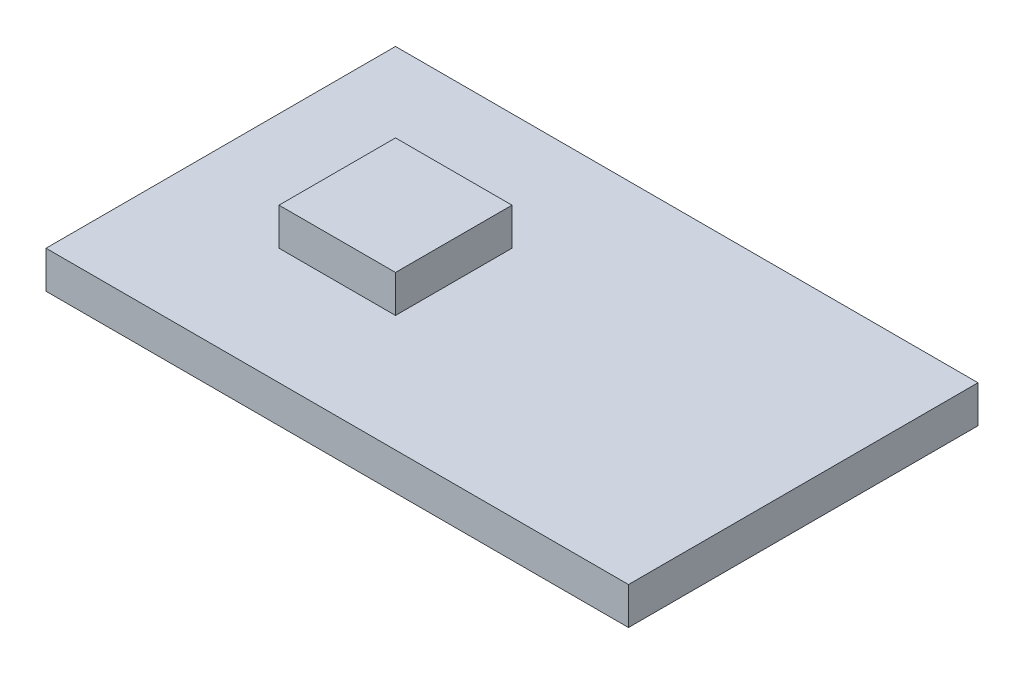
ISO-10303-21;
HEADER;
FILE_DESCRIPTION(('STEP AP214'),'2;1');
FILE_NAME('part.step','',(''),(''),'','','');
FILE_SCHEMA(('AUTOMOTIVE_DESIGN { 1 0 10303 214 1 1 1 1 }'));
ENDSEC;
DATA;
#1=APPLICATION_CONTEXT('core data for automotive mechanical design processes');
#2=APPLICATION_PROTOCOL_DEFINITION('international standard','automotive_design',2000,#1);
#3=PRODUCT_CONTEXT('',#1,'mechanical');
#4=PRODUCT('Part','Part','',(#3));
#5=PRODUCT_RELATED_PRODUCT_CATEGORY('part','',(#4));
#6=PRODUCT_DEFINITION_FORMATION('','',#4);
#7=PRODUCT_DEFINITION_CONTEXT('part definition',#1,'design');
#8=PRODUCT_DEFINITION('design','',#6,#7);
#9=PRODUCT_DEFINITION_SHAPE('','',#8);
#10=(LENGTH_UNIT() NAMED_UNIT(*) SI_UNIT(.MILLI.,.METRE.));
#11=(NAMED_UNIT(*) PLANE_ANGLE_UNIT() SI_UNIT($,.RADIAN.));
#12=(NAMED_UNIT(*) SI_UNIT($,.STERADIAN.) SOLID_ANGLE_UNIT());
#13=UNCERTAINTY_MEASURE_WITH_UNIT(LENGTH_MEASURE(1.E-05),#10,'distance_accuracy_value','');
#14=(GEOMETRIC_REPRESENTATION_CONTEXT(3) GLOBAL_UNCERTAINTY_ASSIGNED_CONTEXT((#13)) GLOBAL_UNIT_ASSIGNED_CONTEXT((#10,
#11,#12)) REPRESENTATION_CONTEXT('',''));
#15=CARTESIAN_POINT('',(0.,0.,0.));
#16=DIRECTION('',(0.,0.,1.));
#17=DIRECTION('',(1.,0.,0.));
#18=AXIS2_PLACEMENT_3D('',#15,#16,#17);
#19=CARTESIAN_POINT('',(7.9375,1.016,-4.7625));
#20=DIRECTION('',(0.,-1.,0.));
#21=DIRECTION('',(0.,0.,-1.));
#22=AXIS2_PLACEMENT_3D('',#19,#20,#21);
#23=PLANE('',#22);
#24=DIRECTION('',(0.,0.,-1.));
#25=VECTOR('',#24,1.);
#26=CARTESIAN_POINT('',(7.9375,1.016,4.7625));
#27=LINE('',#26,#25);
#28=CARTESIAN_POINT('',(7.9375,1.016,4.7625));
#29=VERTEX_POINT('',#28);
#30=CARTESIAN_POINT('',(7.9375,1.016,-4.7625));
#31=VERTEX_POINT('',#30);
#32=EDGE_CURVE('E125',#29,#31,#27,.T.);
#33=ORIENTED_EDGE('',*,*,#32,.T.);
#34=DIRECTION('',(-1.,0.,0.));
#35=VECTOR('',#34,1.);
#36=CARTESIAN_POINT('',(-7.9375,1.016,-4.7625));
#37=LINE('',#36,#35);
#38=CARTESIAN_POINT('',(-7.9375,1.016,-4.7625));
#39=VERTEX_POINT('',#38);
#40=EDGE_CURVE('E128',#31,#39,#37,.T.);
#41=ORIENTED_EDGE('',*,*,#40,.T.);
#42=DIRECTION('',(0.,0.,1.));
#43=VECTOR('',#42,1.);
#44=CARTESIAN_POINT('',(-7.9375,1.016,4.7625));
#45=LINE('',#44,#43);
#46=CARTESIAN_POINT('',(-7.9375,1.016,4.7625));
#47=VERTEX_POINT('',#46);
#48=EDGE_CURVE('E131',#39,#47,#45,.T.);
#49=ORIENTED_EDGE('',*,*,#48,.T.);
#50=DIRECTION('',(1.,0.,0.));
#51=VECTOR('',#50,1.);
#52=CARTESIAN_POINT('',(-7.9375,1.016,4.7625));
#53=LINE('',#52,#51);
#54=EDGE_CURVE('E133',#47,#29,#53,.T.);
#55=ORIENTED_EDGE('',*,*,#54,.T.);
#56=EDGE_LOOP('',(#33,#41,#49,#55));
#57=FACE_BOUND('',#56,.T.);
#58=DIRECTION('',(0.,0.,-1.));
#59=VECTOR('',#58,1.);
#60=CARTESIAN_POINT('',(-1.5875,1.016,1.5875));
#61=LINE('',#60,#59);
#62=CARTESIAN_POINT('',(-1.5875,1.016,1.5875));
#63=VERTEX_POINT('',#62);
#64=CARTESIAN_POINT('',(-1.5875,1.016,-1.5875));
#65=VERTEX_POINT('',#64);
#66=EDGE_CURVE('E115',#63,#65,#61,.T.);
#67=ORIENTED_EDGE('',*,*,#66,.F.);
#68=DIRECTION('',(1.,0.,0.));
#69=VECTOR('',#68,1.);
#70=CARTESIAN_POINT('',(-4.7625,1.016,1.5875));
#71=LINE('',#70,#69);
#72=CARTESIAN_POINT('',(-4.7625,1.016,1.5875));
#73=VERTEX_POINT('',#72);
#74=EDGE_CURVE('E112',#73,#63,#71,.T.);
#75=ORIENTED_EDGE('',*,*,#74,.F.);
#76=DIRECTION('',(0.,0.,1.));
#77=VECTOR('',#76,1.);
#78=CARTESIAN_POINT('',(-4.7625,1.016,1.5875));
#79=LINE('',#78,#77);
#80=CARTESIAN_POINT('',(-4.7625,1.016,-1.5875));
#81=VERTEX_POINT('',#80);
#82=EDGE_CURVE('E50',#81,#73,#79,.T.);
#83=ORIENTED_EDGE('',*,*,#82,.F.);
#84=DIRECTION('',(-1.,0.,0.));
#85=VECTOR('',#84,1.);
#86=CARTESIAN_POINT('',(-4.7625,1.016,-1.5875));
#87=LINE('',#86,#85);
#88=EDGE_CURVE('E45',#65,#81,#87,.T.);
#89=ORIENTED_EDGE('',*,*,#88,.F.);
#90=EDGE_LOOP('',(#67,#75,#83,#89));
#91=FACE_BOUND('',#90,.T.);
#92=ADVANCED_FACE('F30',(#57,#91),#23,.F.);
#93=CARTESIAN_POINT('',(7.9375,1.016,4.7625));
#94=DIRECTION('',(-1.,0.,0.));
#95=DIRECTION('',(0.,0.,1.));
#96=AXIS2_PLACEMENT_3D('',#93,#94,#95);
#97=PLANE('',#96);
#98=DIRECTION('',(0.,0.,-1.));
#99=VECTOR('',#98,1.);
#100=CARTESIAN_POINT('',(7.9375,0.,4.7625));
#101=LINE('',#100,#99);
#102=CARTESIAN_POINT('',(7.9375,0.,4.7625));
#103=VERTEX_POINT('',#102);
#104=CARTESIAN_POINT('',(7.9375,0.,-4.7625));
#105=VERTEX_POINT('',#104);
#106=EDGE_CURVE('E116',#103,#105,#101,.T.);
#107=ORIENTED_EDGE('',*,*,#106,.T.);
#108=DIRECTION('',(0.,-1.,0.));
#109=VECTOR('',#108,1.);
#110=CARTESIAN_POINT('',(7.9375,1.016,-4.7625));
#111=LINE('',#110,#109);
#112=EDGE_CURVE('E11',#31,#105,#111,.T.);
#113=ORIENTED_EDGE('',*,*,#112,.F.);
#114=ORIENTED_EDGE('',*,*,#32,.F.);
#115=DIRECTION('',(0.,-1.,0.));
#116=VECTOR('',#115,1.);
#117=CARTESIAN_POINT('',(7.9375,1.016,4.7625));
#118=LINE('',#117,#116);
#119=EDGE_CURVE('E134',#29,#103,#118,.T.);
#120=ORIENTED_EDGE('',*,*,#119,.T.);
#121=EDGE_LOOP('',(#107,#113,#114,#120));
#122=FACE_BOUND('',#121,.T.);
#123=ADVANCED_FACE('F32',(#122),#97,.F.);
#124=CARTESIAN_POINT('',(-7.9375,1.016,-4.7625));
#125=DIRECTION('',(0.,0.,1.));
#126=DIRECTION('',(1.,0.,0.));
#127=AXIS2_PLACEMENT_3D('',#124,#125,#126);
#128=PLANE('',#127);
#129=DIRECTION('',(-1.,0.,0.));
#130=VECTOR('',#129,1.);
#131=CARTESIAN_POINT('',(-7.9375,0.,-4.7625));
#132=LINE('',#131,#130);
#133=CARTESIAN_POINT('',(-7.9375,0.,-4.7625));
#134=VERTEX_POINT('',#133);
#135=EDGE_CURVE('E119',#105,#134,#132,.T.);
#136=ORIENTED_EDGE('',*,*,#135,.T.);
#137=DIRECTION('',(0.,-1.,0.));
#138=VECTOR('',#137,1.);
#139=CARTESIAN_POINT('',(-7.9375,1.016,-4.7625));
#140=LINE('',#139,#138);
#141=EDGE_CURVE('E38',#39,#134,#140,.T.);
#142=ORIENTED_EDGE('',*,*,#141,.F.);
#143=ORIENTED_EDGE('',*,*,#40,.F.);
#144=ORIENTED_EDGE('',*,*,#112,.T.);
#145=EDGE_LOOP('',(#136,#142,#143,#144));
#146=FACE_BOUND('',#145,.T.);
#147=ADVANCED_FACE('F164',(#146),#128,.F.);
#148=CARTESIAN_POINT('',(-7.9375,1.016,4.7625));
#149=DIRECTION('',(1.,0.,0.));
#150=DIRECTION('',(0.,0.,-1.));
#151=AXIS2_PLACEMENT_3D('',#148,#149,#150);
#152=PLANE('',#151);
#153=DIRECTION('',(0.,0.,1.));
#154=VECTOR('',#153,1.);
#155=CARTESIAN_POINT('',(-7.9375,0.,4.7625));
#156=LINE('',#155,#154);
#157=CARTESIAN_POINT('',(-7.9375,0.,4.7625));
#158=VERTEX_POINT('',#157);
#159=EDGE_CURVE('E137',#134,#158,#156,.T.);
#160=ORIENTED_EDGE('',*,*,#159,.T.);
#161=DIRECTION('',(0.,-1.,0.));
#162=VECTOR('',#161,1.);
#163=CARTESIAN_POINT('',(-7.9375,1.016,4.7625));
#164=LINE('',#163,#162);
#165=EDGE_CURVE('E142',#47,#158,#164,.T.);
#166=ORIENTED_EDGE('',*,*,#165,.F.);
#167=ORIENTED_EDGE('',*,*,#48,.F.);
#168=ORIENTED_EDGE('',*,*,#141,.T.);
#169=EDGE_LOOP('',(#160,#166,#167,#168));
#170=FACE_BOUND('',#169,.T.);
#171=ADVANCED_FACE('F149',(#170),#152,.F.);
#172=CARTESIAN_POINT('',(-7.9375,1.016,4.7625));
#173=DIRECTION('',(0.,0.,-1.));
#174=DIRECTION('',(-1.,0.,0.));
#175=AXIS2_PLACEMENT_3D('',#172,#173,#174);
#176=PLANE('',#175);
#177=DIRECTION('',(1.,0.,0.));
#178=VECTOR('',#177,1.);
#179=CARTESIAN_POINT('',(-7.9375,0.,4.7625));
#180=LINE('',#179,#178);
#181=EDGE_CURVE('E129',#158,#103,#180,.T.);
#182=ORIENTED_EDGE('',*,*,#181,.T.);
#183=ORIENTED_EDGE('',*,*,#119,.F.);
#184=ORIENTED_EDGE('',*,*,#54,.F.);
#185=ORIENTED_EDGE('',*,*,#165,.T.);
#186=EDGE_LOOP('',(#182,#183,#184,#185));
#187=FACE_BOUND('',#186,.T.);
#188=ADVANCED_FACE('F158',(#187),#176,.F.);
#189=CARTESIAN_POINT('',(7.9375,0.,-4.7625));
#190=DIRECTION('',(0.,-1.,0.));
#191=DIRECTION('',(0.,0.,-1.));
#192=AXIS2_PLACEMENT_3D('',#189,#190,#191);
#193=PLANE('',#192);
#194=ORIENTED_EDGE('',*,*,#106,.F.);
#195=ORIENTED_EDGE('',*,*,#181,.F.);
#196=ORIENTED_EDGE('',*,*,#159,.F.);
#197=ORIENTED_EDGE('',*,*,#135,.F.);
#198=EDGE_LOOP('',(#194,#195,#196,#197));
#199=FACE_BOUND('',#198,.T.);
#200=ADVANCED_FACE('F155',(#199),#193,.T.);
#201=CARTESIAN_POINT('',(-1.5875,2.032,1.5875));
#202=DIRECTION('',(-1.,0.,0.));
#203=DIRECTION('',(0.,0.,1.));
#204=AXIS2_PLACEMENT_3D('',#201,#202,#203);
#205=PLANE('',#204);
#206=ORIENTED_EDGE('',*,*,#66,.T.);
#207=DIRECTION('',(0.,-1.,0.));
#208=VECTOR('',#207,1.);
#209=CARTESIAN_POINT('',(-1.5875,2.032,-1.5875));
#210=LINE('',#209,#208);
#211=CARTESIAN_POINT('',(-1.5875,2.032,-1.5875));
#212=VERTEX_POINT('',#211);
#213=EDGE_CURVE('E96',#212,#65,#210,.T.);
#214=ORIENTED_EDGE('',*,*,#213,.F.);
#215=DIRECTION('',(0.,0.,-1.));
#216=VECTOR('',#215,1.);
#217=CARTESIAN_POINT('',(-1.5875,2.032,1.5875));
#218=LINE('',#217,#216);
#219=CARTESIAN_POINT('',(-1.5875,2.032,1.5875));
#220=VERTEX_POINT('',#219);
#221=EDGE_CURVE('E103',#220,#212,#218,.T.);
#222=ORIENTED_EDGE('',*,*,#221,.F.);
#223=DIRECTION('',(0.,-1.,0.));
#224=VECTOR('',#223,1.);
#225=CARTESIAN_POINT('',(-1.5875,2.032,1.5875));
#226=LINE('',#225,#224);
#227=EDGE_CURVE('E257',#220,#63,#226,.T.);
#228=ORIENTED_EDGE('',*,*,#227,.T.);
#229=EDGE_LOOP('',(#206,#214,#222,#228));
#230=FACE_BOUND('',#229,.T.);
#231=ADVANCED_FACE('F114',(#230),#205,.F.);
#232=CARTESIAN_POINT('',(-4.7625,2.032,-1.5875));
#233=DIRECTION('',(0.,0.,1.));
#234=DIRECTION('',(1.,0.,0.));
#235=AXIS2_PLACEMENT_3D('',#232,#233,#234);
#236=PLANE('',#235);
#237=ORIENTED_EDGE('',*,*,#88,.T.);
#238=DIRECTION('',(0.,-1.,0.));
#239=VECTOR('',#238,1.);
#240=CARTESIAN_POINT('',(-4.7625,2.032,-1.5875));
#241=LINE('',#240,#239);
#242=CARTESIAN_POINT('',(-4.7625,2.032,-1.5875));
#243=VERTEX_POINT('',#242);
#244=EDGE_CURVE('E99',#243,#81,#241,.T.);
#245=ORIENTED_EDGE('',*,*,#244,.F.);
#246=DIRECTION('',(-1.,0.,0.));
#247=VECTOR('',#246,1.);
#248=CARTESIAN_POINT('',(-4.7625,2.032,-1.5875));
#249=LINE('',#248,#247);
#250=EDGE_CURVE('E92',#212,#243,#249,.T.);
#251=ORIENTED_EDGE('',*,*,#250,.F.);
#252=ORIENTED_EDGE('',*,*,#213,.T.);
#253=EDGE_LOOP('',(#237,#245,#251,#252));
#254=FACE_BOUND('',#253,.T.);
#255=ADVANCED_FACE('F94',(#254),#236,.F.);
#256=CARTESIAN_POINT('',(-4.7625,2.032,1.5875));
#257=DIRECTION('',(1.,0.,0.));
#258=DIRECTION('',(0.,0.,-1.));
#259=AXIS2_PLACEMENT_3D('',#256,#257,#258);
#260=PLANE('',#259);
#261=ORIENTED_EDGE('',*,*,#82,.T.);
#262=DIRECTION('',(0.,-1.,0.));
#263=VECTOR('',#262,1.);
#264=CARTESIAN_POINT('',(-4.7625,2.032,1.5875));
#265=LINE('',#264,#263);
#266=CARTESIAN_POINT('',(-4.7625,2.032,1.5875));
#267=VERTEX_POINT('',#266);
#268=EDGE_CURVE('E121',#267,#73,#265,.T.);
#269=ORIENTED_EDGE('',*,*,#268,.F.);
#270=DIRECTION('',(0.,0.,1.));
#271=VECTOR('',#270,1.);
#272=CARTESIAN_POINT('',(-4.7625,2.032,1.5875));
#273=LINE('',#272,#271);
#274=EDGE_CURVE('E102',#243,#267,#273,.T.);
#275=ORIENTED_EDGE('',*,*,#274,.F.);
#276=ORIENTED_EDGE('',*,*,#244,.T.);
#277=EDGE_LOOP('',(#261,#269,#275,#276));
#278=FACE_BOUND('',#277,.T.);
#279=ADVANCED_FACE('F200',(#278),#260,.F.);
#280=CARTESIAN_POINT('',(-4.7625,2.032,1.5875));
#281=DIRECTION('',(0.,0.,-1.));
#282=DIRECTION('',(-1.,0.,0.));
#283=AXIS2_PLACEMENT_3D('',#280,#281,#282);
#284=PLANE('',#283);
#285=ORIENTED_EDGE('',*,*,#74,.T.);
#286=ORIENTED_EDGE('',*,*,#227,.F.);
#287=DIRECTION('',(1.,0.,0.));
#288=VECTOR('',#287,1.);
#289=CARTESIAN_POINT('',(-4.7625,2.032,1.5875));
#290=LINE('',#289,#288);
#291=EDGE_CURVE('E108',#267,#220,#290,.T.);
#292=ORIENTED_EDGE('',*,*,#291,.F.);
#293=ORIENTED_EDGE('',*,*,#268,.T.);
#294=EDGE_LOOP('',(#285,#286,#292,#293));
#295=FACE_BOUND('',#294,.T.);
#296=ADVANCED_FACE('F206',(#295),#284,.F.);
#297=CARTESIAN_POINT('',(-1.5875,2.032,-1.5875));
#298=DIRECTION('',(0.,-1.,0.));
#299=DIRECTION('',(0.,0.,-1.));
#300=AXIS2_PLACEMENT_3D('',#297,#298,#299);
#301=PLANE('',#300);
#302=ORIENTED_EDGE('',*,*,#221,.T.);
#303=ORIENTED_EDGE('',*,*,#250,.T.);
#304=ORIENTED_EDGE('',*,*,#274,.T.);
#305=ORIENTED_EDGE('',*,*,#291,.T.);
#306=EDGE_LOOP('',(#302,#303,#304,#305));
#307=FACE_BOUND('',#306,.T.);
#308=ADVANCED_FACE('F106',(#307),#301,.F.);
#309=CLOSED_SHELL('',(#92,#123,#147,#171,#188,#200,#231,#255,#279,#296,#308));
#310=MANIFOLD_SOLID_BREP('B2',#309);
#311=ADVANCED_BREP_SHAPE_REPRESENTATION('',(#18,#310),#14);
#312=SHAPE_DEFINITION_REPRESENTATION(#9,#311);
ENDSEC;
END-ISO-10303-21;
